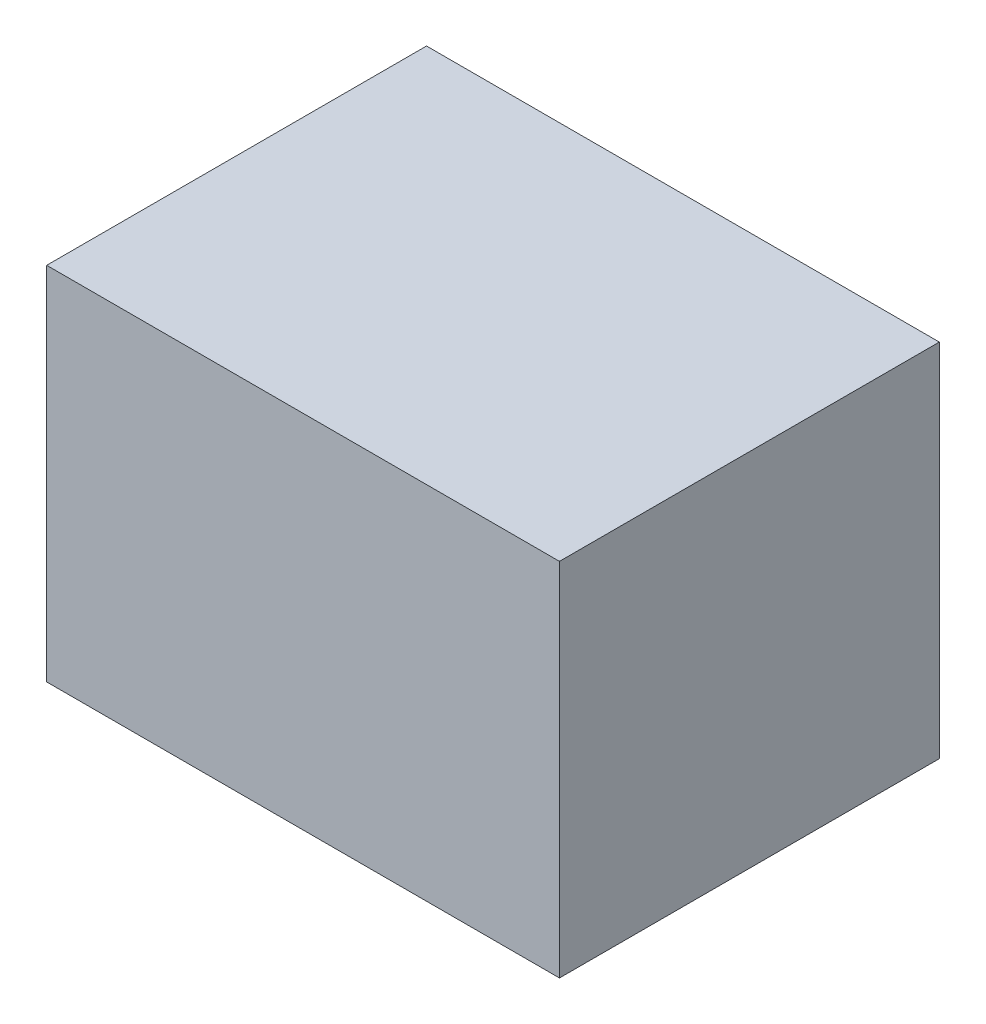
ISO-10303-21;
HEADER;
FILE_DESCRIPTION(('STEP AP214'),'2;1');
FILE_NAME('part.step','',(''),(''),'','','');
FILE_SCHEMA(('AUTOMOTIVE_DESIGN { 1 0 10303 214 1 1 1 1 }'));
ENDSEC;
DATA;
#1=APPLICATION_CONTEXT('core data for automotive mechanical design processes');
#2=APPLICATION_PROTOCOL_DEFINITION('international standard','automotive_design',2000,#1);
#3=PRODUCT_CONTEXT('',#1,'mechanical');
#4=PRODUCT('Part','Part','',(#3));
#5=PRODUCT_RELATED_PRODUCT_CATEGORY('part','',(#4));
#6=PRODUCT_DEFINITION_FORMATION('','',#4);
#7=PRODUCT_DEFINITION_CONTEXT('part definition',#1,'design');
#8=PRODUCT_DEFINITION('design','',#6,#7);
#9=PRODUCT_DEFINITION_SHAPE('','',#8);
#10=(LENGTH_UNIT() NAMED_UNIT(*) SI_UNIT(.MILLI.,.METRE.));
#11=(NAMED_UNIT(*) PLANE_ANGLE_UNIT() SI_UNIT($,.RADIAN.));
#12=(NAMED_UNIT(*) SI_UNIT($,.STERADIAN.) SOLID_ANGLE_UNIT());
#13=UNCERTAINTY_MEASURE_WITH_UNIT(LENGTH_MEASURE(1.E-05),#10,'distance_accuracy_value','');
#14=(GEOMETRIC_REPRESENTATION_CONTEXT(3) GLOBAL_UNCERTAINTY_ASSIGNED_CONTEXT((#13)) GLOBAL_UNIT_ASSIGNED_CONTEXT((#10,
#11,#12)) REPRESENTATION_CONTEXT('',''));
#15=CARTESIAN_POINT('',(0.,0.,0.));
#16=DIRECTION('',(0.,0.,1.));
#17=DIRECTION('',(1.,0.,0.));
#18=AXIS2_PLACEMENT_3D('',#15,#16,#17);
#19=CARTESIAN_POINT('',(-1.34999984,0.95000064,0.));
#20=DIRECTION('',(0.,1.,0.));
#21=DIRECTION('',(0.,0.,1.));
#22=AXIS2_PLACEMENT_3D('',#19,#20,#21);
#23=PLANE('',#22);
#24=DIRECTION('',(0.,0.,-1.));
#25=VECTOR('',#24,1.);
#26=CARTESIAN_POINT('',(1.34999984,0.95000064,0.));
#27=LINE('',#26,#25);
#28=CARTESIAN_POINT('',(1.34999984,0.95000064,0.));
#29=VERTEX_POINT('',#28);
#30=CARTESIAN_POINT('',(1.34999984,0.95000064,2.00000108));
#31=VERTEX_POINT('',#30);
#32=EDGE_CURVE('E20',#29,#31,#27,.F.);
#33=ORIENTED_EDGE('',*,*,#32,.F.);
#34=DIRECTION('',(1.,0.,0.));
#35=VECTOR('',#34,1.);
#36=CARTESIAN_POINT('',(1.34999984,0.95000064,0.));
#37=LINE('',#36,#35);
#38=CARTESIAN_POINT('',(-1.34999984,0.95000064,0.));
#39=VERTEX_POINT('',#38);
#40=EDGE_CURVE('E80',#29,#39,#37,.F.);
#41=ORIENTED_EDGE('',*,*,#40,.T.);
#42=DIRECTION('',(0.,0.,1.));
#43=VECTOR('',#42,1.);
#44=CARTESIAN_POINT('',(-1.34999984,0.95000064,0.));
#45=LINE('',#44,#43);
#46=CARTESIAN_POINT('',(-1.34999984,0.95000064,2.00000108));
#47=VERTEX_POINT('',#46);
#48=EDGE_CURVE('E68',#47,#39,#45,.F.);
#49=ORIENTED_EDGE('',*,*,#48,.F.);
#50=DIRECTION('',(1.,0.,0.));
#51=VECTOR('',#50,1.);
#52=CARTESIAN_POINT('',(1.34999984,0.95000064,2.00000108));
#53=LINE('',#52,#51);
#54=EDGE_CURVE('E56',#31,#47,#53,.F.);
#55=ORIENTED_EDGE('',*,*,#54,.F.);
#56=EDGE_LOOP('',(#33,#41,#49,#55));
#57=FACE_BOUND('',#56,.T.);
#58=ADVANCED_FACE('F17',(#57),#23,.T.);
#59=CARTESIAN_POINT('',(1.34999984,0.95000064,0.));
#60=DIRECTION('',(1.,0.,0.));
#61=DIRECTION('',(0.,0.,-1.));
#62=AXIS2_PLACEMENT_3D('',#59,#60,#61);
#63=PLANE('',#62);
#64=DIRECTION('',(0.,0.,-1.));
#65=VECTOR('',#64,1.);
#66=CARTESIAN_POINT('',(1.34999984,-0.9499981,0.));
#67=LINE('',#66,#65);
#68=CARTESIAN_POINT('',(1.34999984,-0.9499981,0.));
#69=VERTEX_POINT('',#68);
#70=CARTESIAN_POINT('',(1.34999984,-0.9499981,2.00000108));
#71=VERTEX_POINT('',#70);
#72=EDGE_CURVE('E83',#69,#71,#67,.F.);
#73=ORIENTED_EDGE('',*,*,#72,.F.);
#74=DIRECTION('',(0.,1.,0.));
#75=VECTOR('',#74,1.);
#76=CARTESIAN_POINT('',(1.34999984,-0.9499981,0.));
#77=LINE('',#76,#75);
#78=EDGE_CURVE('E65',#69,#29,#77,.T.);
#79=ORIENTED_EDGE('',*,*,#78,.T.);
#80=ORIENTED_EDGE('',*,*,#32,.T.);
#81=DIRECTION('',(0.,1.,0.));
#82=VECTOR('',#81,1.);
#83=CARTESIAN_POINT('',(1.34999984,-0.9499981,2.00000108));
#84=LINE('',#83,#82);
#85=EDGE_CURVE('E62',#71,#31,#84,.T.);
#86=ORIENTED_EDGE('',*,*,#85,.F.);
#87=EDGE_LOOP('',(#73,#79,#80,#86));
#88=FACE_BOUND('',#87,.T.);
#89=ADVANCED_FACE('F61',(#88),#63,.T.);
#90=CARTESIAN_POINT('',(1.34999984,-0.9499981,2.00000108));
#91=DIRECTION('',(0.,0.,1.));
#92=DIRECTION('',(1.,0.,0.));
#93=AXIS2_PLACEMENT_3D('',#90,#91,#92);
#94=PLANE('',#93);
#95=DIRECTION('',(0.,1.,0.));
#96=VECTOR('',#95,1.);
#97=CARTESIAN_POINT('',(-1.34999984,-0.9499981,2.00000108));
#98=LINE('',#97,#96);
#99=CARTESIAN_POINT('',(-1.34999984,-0.9499981,2.00000108));
#100=VERTEX_POINT('',#99);
#101=EDGE_CURVE('E70',#100,#47,#98,.T.);
#102=ORIENTED_EDGE('',*,*,#101,.F.);
#103=DIRECTION('',(1.,0.,0.));
#104=VECTOR('',#103,1.);
#105=CARTESIAN_POINT('',(1.34999984,-0.9499981,2.00000108));
#106=LINE('',#105,#104);
#107=EDGE_CURVE('E74',#71,#100,#106,.F.);
#108=ORIENTED_EDGE('',*,*,#107,.F.);
#109=ORIENTED_EDGE('',*,*,#85,.T.);
#110=ORIENTED_EDGE('',*,*,#54,.T.);
#111=EDGE_LOOP('',(#102,#108,#109,#110));
#112=FACE_BOUND('',#111,.T.);
#113=ADVANCED_FACE('F72',(#112),#94,.T.);
#114=CARTESIAN_POINT('',(-1.34999984,-0.9499981,0.));
#115=DIRECTION('',(-1.,0.,0.));
#116=DIRECTION('',(0.,0.,1.));
#117=AXIS2_PLACEMENT_3D('',#114,#115,#116);
#118=PLANE('',#117);
#119=ORIENTED_EDGE('',*,*,#48,.T.);
#120=DIRECTION('',(0.,1.,0.));
#121=VECTOR('',#120,1.);
#122=CARTESIAN_POINT('',(-1.34999984,-0.9499981,0.));
#123=LINE('',#122,#121);
#124=CARTESIAN_POINT('',(-1.34999984,-0.9499981,0.));
#125=VERTEX_POINT('',#124);
#126=EDGE_CURVE('E35',#39,#125,#123,.F.);
#127=ORIENTED_EDGE('',*,*,#126,.T.);
#128=DIRECTION('',(0.,0.,-1.));
#129=VECTOR('',#128,1.);
#130=CARTESIAN_POINT('',(-1.34999984,-0.9499981,0.));
#131=LINE('',#130,#129);
#132=EDGE_CURVE('E26',#100,#125,#131,.T.);
#133=ORIENTED_EDGE('',*,*,#132,.F.);
#134=ORIENTED_EDGE('',*,*,#101,.T.);
#135=EDGE_LOOP('',(#119,#127,#133,#134));
#136=FACE_BOUND('',#135,.T.);
#137=ADVANCED_FACE('F89',(#136),#118,.T.);
#138=CARTESIAN_POINT('',(1.34999984,-0.9499981,0.));
#139=DIRECTION('',(0.,0.,1.));
#140=DIRECTION('',(1.,0.,0.));
#141=AXIS2_PLACEMENT_3D('',#138,#139,#140);
#142=PLANE('',#141);
#143=ORIENTED_EDGE('',*,*,#126,.F.);
#144=ORIENTED_EDGE('',*,*,#40,.F.);
#145=ORIENTED_EDGE('',*,*,#78,.F.);
#146=DIRECTION('',(1.,0.,0.));
#147=VECTOR('',#146,1.);
#148=CARTESIAN_POINT('',(1.34999984,-0.9499981,0.));
#149=LINE('',#148,#147);
#150=EDGE_CURVE('E11',#125,#69,#149,.T.);
#151=ORIENTED_EDGE('',*,*,#150,.F.);
#152=EDGE_LOOP('',(#143,#144,#145,#151));
#153=FACE_BOUND('',#152,.T.);
#154=ADVANCED_FACE('F91',(#153),#142,.F.);
#155=CARTESIAN_POINT('',(1.34999984,-0.9499981,0.));
#156=DIRECTION('',(0.,-1.,0.));
#157=DIRECTION('',(0.,0.,-1.));
#158=AXIS2_PLACEMENT_3D('',#155,#156,#157);
#159=PLANE('',#158);
#160=ORIENTED_EDGE('',*,*,#132,.T.);
#161=ORIENTED_EDGE('',*,*,#150,.T.);
#162=ORIENTED_EDGE('',*,*,#72,.T.);
#163=ORIENTED_EDGE('',*,*,#107,.T.);
#164=EDGE_LOOP('',(#160,#161,#162,#163));
#165=FACE_BOUND('',#164,.T.);
#166=ADVANCED_FACE('F88',(#165),#159,.T.);
#167=CLOSED_SHELL('',(#58,#89,#113,#137,#154,#166));
#168=MANIFOLD_SOLID_BREP('B1',#167);
#169=ADVANCED_BREP_SHAPE_REPRESENTATION('',(#18,#168),#14);
#170=SHAPE_DEFINITION_REPRESENTATION(#9,#169);
ENDSEC;
END-ISO-10303-21;
